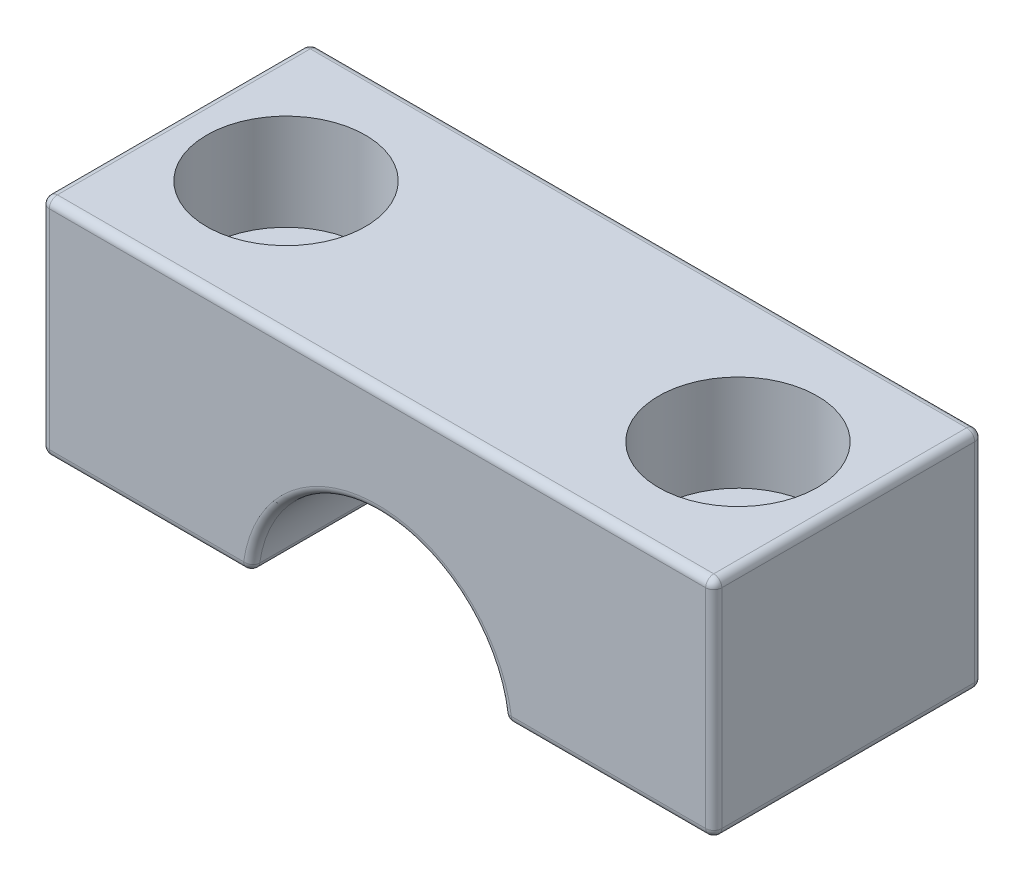
ISO-10303-21;
HEADER;
FILE_DESCRIPTION(('STEP AP214'),'2;1');
FILE_NAME('part.step','',(''),(''),'','','');
FILE_SCHEMA(('AUTOMOTIVE_DESIGN { 1 0 10303 214 1 1 1 1 }'));
ENDSEC;
DATA;
#1=APPLICATION_CONTEXT('core data for automotive mechanical design processes');
#2=APPLICATION_PROTOCOL_DEFINITION('international standard','automotive_design',2000,#1);
#3=PRODUCT_CONTEXT('',#1,'mechanical');
#4=PRODUCT('Part','Part','',(#3));
#5=PRODUCT_RELATED_PRODUCT_CATEGORY('part','',(#4));
#6=PRODUCT_DEFINITION_FORMATION('','',#4);
#7=PRODUCT_DEFINITION_CONTEXT('part definition',#1,'design');
#8=PRODUCT_DEFINITION('design','',#6,#7);
#9=PRODUCT_DEFINITION_SHAPE('','',#8);
#10=(LENGTH_UNIT() NAMED_UNIT(*) SI_UNIT(.MILLI.,.METRE.));
#11=(NAMED_UNIT(*) PLANE_ANGLE_UNIT() SI_UNIT($,.RADIAN.));
#12=(NAMED_UNIT(*) SI_UNIT($,.STERADIAN.) SOLID_ANGLE_UNIT());
#13=UNCERTAINTY_MEASURE_WITH_UNIT(LENGTH_MEASURE(1.E-05),#10,'distance_accuracy_value','');
#14=(GEOMETRIC_REPRESENTATION_CONTEXT(3) GLOBAL_UNCERTAINTY_ASSIGNED_CONTEXT((#13)) GLOBAL_UNIT_ASSIGNED_CONTEXT((#10,
#11,#12)) REPRESENTATION_CONTEXT('',''));
#15=CARTESIAN_POINT('',(0.,0.,0.));
#16=DIRECTION('',(0.,0.,1.));
#17=DIRECTION('',(1.,0.,0.));
#18=AXIS2_PLACEMENT_3D('',#15,#16,#17);
#19=CARTESIAN_POINT('',(-10.668,0.,-6.35));
#20=DIRECTION('',(0.,1.,0.));
#21=DIRECTION('',(-1.,0.,0.));
#22=AXIS2_PLACEMENT_3D('',#19,#20,#21);
#23=CYLINDRICAL_SURFACE('',#22,2.3368);
#24=CARTESIAN_POINT('',(-10.668,19.558,-6.35));
#25=DIRECTION('',(0.,-1.,0.));
#26=DIRECTION('',(1.,0.,0.));
#27=AXIS2_PLACEMENT_3D('',#24,#25,#26);
#28=CIRCLE('',#27,2.3368);
#29=CARTESIAN_POINT('',(-8.3312,19.558,-6.35));
#30=VERTEX_POINT('',#29);
#31=EDGE_CURVE('E382',#30,#30,#28,.T.);
#32=ORIENTED_EDGE('',*,*,#31,.T.);
#33=EDGE_LOOP('',(#32));
#34=FACE_BOUND('',#33,.T.);
#35=CARTESIAN_POINT('',(-10.668,25.6159,-6.35));
#36=DIRECTION('',(0.,1.,0.));
#37=DIRECTION('',(-1.,0.,0.));
#38=AXIS2_PLACEMENT_3D('',#35,#36,#37);
#39=CIRCLE('',#38,2.3368);
#40=CARTESIAN_POINT('',(-13.0048,25.6159,-6.35));
#41=VERTEX_POINT('',#40);
#42=EDGE_CURVE('E372',#41,#41,#39,.F.);
#43=ORIENTED_EDGE('',*,*,#42,.F.);
#44=EDGE_LOOP('',(#43));
#45=FACE_BOUND('',#44,.T.);
#46=ADVANCED_FACE('F41',(#34,#45),#23,.F.);
#47=CARTESIAN_POINT('',(-15.875,19.558,-12.7));
#48=DIRECTION('',(-1.,0.,0.));
#49=DIRECTION('',(0.,0.,1.));
#50=AXIS2_PLACEMENT_3D('',#47,#48,#49);
#51=PLANE('',#50);
#52=DIRECTION('',(0.,0.,1.));
#53=VECTOR('',#52,1.);
#54=CARTESIAN_POINT('',(-15.875,29.7815,-12.7));
#55=LINE('',#54,#53);
#56=CARTESIAN_POINT('',(-15.875,29.7815,-0.381));
#57=VERTEX_POINT('',#56);
#58=CARTESIAN_POINT('',(-15.875,29.7815,-12.319));
#59=VERTEX_POINT('',#58);
#60=EDGE_CURVE('E61',#57,#59,#55,.F.);
#61=ORIENTED_EDGE('',*,*,#60,.T.);
#62=DIRECTION('',(0.,-1.,0.));
#63=VECTOR('',#62,1.);
#64=CARTESIAN_POINT('',(-15.875,19.558,-12.319));
#65=LINE('',#64,#63);
#66=CARTESIAN_POINT('',(-15.875,19.939,-12.319));
#67=VERTEX_POINT('',#66);
#68=EDGE_CURVE('E11',#59,#67,#65,.T.);
#69=ORIENTED_EDGE('',*,*,#68,.T.);
#70=DIRECTION('',(0.,0.,1.));
#71=VECTOR('',#70,1.);
#72=CARTESIAN_POINT('',(-15.875,19.939,-12.7));
#73=LINE('',#72,#71);
#74=CARTESIAN_POINT('',(-15.875,19.939,-0.381));
#75=VERTEX_POINT('',#74);
#76=EDGE_CURVE('E50',#67,#75,#73,.T.);
#77=ORIENTED_EDGE('',*,*,#76,.T.);
#78=DIRECTION('',(0.,-1.,0.));
#79=VECTOR('',#78,1.);
#80=CARTESIAN_POINT('',(-15.875,19.558,-0.380999999999999));
#81=LINE('',#80,#79);
#82=EDGE_CURVE('E265',#75,#57,#81,.F.);
#83=ORIENTED_EDGE('',*,*,#82,.T.);
#84=EDGE_LOOP('',(#61,#69,#77,#83));
#85=FACE_BOUND('',#84,.T.);
#86=ADVANCED_FACE('F446',(#85),#51,.T.);
#87=CARTESIAN_POINT('',(-15.875,30.1625,-12.7));
#88=DIRECTION('',(0.,1.,0.));
#89=DIRECTION('',(-1.,0.,0.));
#90=AXIS2_PLACEMENT_3D('',#87,#88,#89);
#91=PLANE('',#90);
#92=DIRECTION('',(-1.,0.,0.));
#93=VECTOR('',#92,1.);
#94=CARTESIAN_POINT('',(-15.875,30.1625,-0.380999999999999));
#95=LINE('',#94,#93);
#96=CARTESIAN_POINT('',(-15.494,30.1625,-0.381));
#97=VERTEX_POINT('',#96);
#98=CARTESIAN_POINT('',(15.494,30.1625,-0.381));
#99=VERTEX_POINT('',#98);
#100=EDGE_CURVE('E201',#97,#99,#95,.F.);
#101=ORIENTED_EDGE('',*,*,#100,.T.);
#102=DIRECTION('',(0.,0.,1.));
#103=VECTOR('',#102,1.);
#104=CARTESIAN_POINT('',(15.494,30.1625,-12.7));
#105=LINE('',#104,#103);
#106=CARTESIAN_POINT('',(15.494,30.1625,-12.319));
#107=VERTEX_POINT('',#106);
#108=EDGE_CURVE('E172',#99,#107,#105,.F.);
#109=ORIENTED_EDGE('',*,*,#108,.T.);
#110=DIRECTION('',(-1.,0.,0.));
#111=VECTOR('',#110,1.);
#112=CARTESIAN_POINT('',(-15.875,30.1625,-12.319));
#113=LINE('',#112,#111);
#114=CARTESIAN_POINT('',(-15.494,30.1625,-12.319));
#115=VERTEX_POINT('',#114);
#116=EDGE_CURVE('E209',#107,#115,#113,.T.);
#117=ORIENTED_EDGE('',*,*,#116,.T.);
#118=DIRECTION('',(0.,0.,1.));
#119=VECTOR('',#118,1.);
#120=CARTESIAN_POINT('',(-15.494,30.1625,-12.7));
#121=LINE('',#120,#119);
#122=EDGE_CURVE('E203',#115,#97,#121,.T.);
#123=ORIENTED_EDGE('',*,*,#122,.T.);
#124=EDGE_LOOP('',(#101,#109,#117,#123));
#125=FACE_BOUND('',#124,.T.);
#126=CARTESIAN_POINT('',(-10.668,30.1625,-6.35));
#127=DIRECTION('',(0.,1.,0.));
#128=DIRECTION('',(-1.,0.,0.));
#129=AXIS2_PLACEMENT_3D('',#126,#127,#128);
#130=CIRCLE('',#129,3.7465);
#131=CARTESIAN_POINT('',(-14.4145,30.1625,-6.35));
#132=VERTEX_POINT('',#131);
#133=EDGE_CURVE('E361',#132,#132,#130,.T.);
#134=ORIENTED_EDGE('',*,*,#133,.F.);
#135=EDGE_LOOP('',(#134));
#136=FACE_BOUND('',#135,.T.);
#137=CARTESIAN_POINT('',(10.668,30.1625,-6.35));
#138=DIRECTION('',(0.,1.,0.));
#139=DIRECTION('',(1.,0.,0.));
#140=AXIS2_PLACEMENT_3D('',#137,#138,#139);
#141=CIRCLE('',#140,3.7465);
#142=CARTESIAN_POINT('',(14.4145,30.1625,-6.35));
#143=VERTEX_POINT('',#142);
#144=EDGE_CURVE('E379',#143,#143,#141,.T.);
#145=ORIENTED_EDGE('',*,*,#144,.F.);
#146=EDGE_LOOP('',(#145));
#147=FACE_BOUND('',#146,.T.);
#148=ADVANCED_FACE('F414',(#125,#136,#147),#91,.T.);
#149=CARTESIAN_POINT('',(15.875,19.558,-12.7));
#150=DIRECTION('',(1.,0.,0.));
#151=DIRECTION('',(0.,0.,-1.));
#152=AXIS2_PLACEMENT_3D('',#149,#150,#151);
#153=PLANE('',#152);
#154=DIRECTION('',(0.,1.,0.));
#155=VECTOR('',#154,1.);
#156=CARTESIAN_POINT('',(15.875,30.1625,-12.319));
#157=LINE('',#156,#155);
#158=CARTESIAN_POINT('',(15.875,19.939,-12.319));
#159=VERTEX_POINT('',#158);
#160=CARTESIAN_POINT('',(15.875,29.7815,-12.319));
#161=VERTEX_POINT('',#160);
#162=EDGE_CURVE('E199',#159,#161,#157,.T.);
#163=ORIENTED_EDGE('',*,*,#162,.T.);
#164=DIRECTION('',(0.,0.,1.));
#165=VECTOR('',#164,1.);
#166=CARTESIAN_POINT('',(15.875,29.7815,-12.7));
#167=LINE('',#166,#165);
#168=CARTESIAN_POINT('',(15.875,29.7815,-0.381));
#169=VERTEX_POINT('',#168);
#170=EDGE_CURVE('E170',#161,#169,#167,.T.);
#171=ORIENTED_EDGE('',*,*,#170,.T.);
#172=DIRECTION('',(0.,1.,0.));
#173=VECTOR('',#172,1.);
#174=CARTESIAN_POINT('',(15.875,19.558,-0.380999999999999));
#175=LINE('',#174,#173);
#176=CARTESIAN_POINT('',(15.875,19.939,-0.381));
#177=VERTEX_POINT('',#176);
#178=EDGE_CURVE('E188',#169,#177,#175,.F.);
#179=ORIENTED_EDGE('',*,*,#178,.T.);
#180=DIRECTION('',(0.,0.,1.));
#181=VECTOR('',#180,1.);
#182=CARTESIAN_POINT('',(15.875,19.939,-12.7));
#183=LINE('',#182,#181);
#184=EDGE_CURVE('E194',#177,#159,#183,.F.);
#185=ORIENTED_EDGE('',*,*,#184,.T.);
#186=EDGE_LOOP('',(#163,#171,#179,#185));
#187=FACE_BOUND('',#186,.T.);
#188=ADVANCED_FACE('F197',(#187),#153,.T.);
#189=CARTESIAN_POINT('',(5.97845598796211,19.558,-12.7));
#190=DIRECTION('',(0.,-1.,0.));
#191=DIRECTION('',(1.,0.,0.));
#192=AXIS2_PLACEMENT_3D('',#189,#190,#191);
#193=PLANE('',#192);
#194=DIRECTION('',(0.,0.,1.));
#195=VECTOR('',#194,1.);
#196=CARTESIAN_POINT('',(6.31876886742979,19.558,-12.7));
#197=LINE('',#196,#195);
#198=CARTESIAN_POINT('',(6.31876886742979,19.558,-0.381));
#199=VERTEX_POINT('',#198);
#200=CARTESIAN_POINT('',(6.31876886742979,19.558,-12.319));
#201=VERTEX_POINT('',#200);
#202=EDGE_CURVE('E227',#199,#201,#197,.F.);
#203=ORIENTED_EDGE('',*,*,#202,.T.);
#204=DIRECTION('',(1.,0.,0.));
#205=VECTOR('',#204,1.);
#206=CARTESIAN_POINT('',(15.875,19.558,-12.319));
#207=LINE('',#206,#205);
#208=CARTESIAN_POINT('',(15.494,19.558,-12.319));
#209=VERTEX_POINT('',#208);
#210=EDGE_CURVE('E232',#201,#209,#207,.T.);
#211=ORIENTED_EDGE('',*,*,#210,.T.);
#212=DIRECTION('',(0.,0.,1.));
#213=VECTOR('',#212,1.);
#214=CARTESIAN_POINT('',(15.494,19.558,-12.7));
#215=LINE('',#214,#213);
#216=CARTESIAN_POINT('',(15.494,19.558,-0.381));
#217=VERTEX_POINT('',#216);
#218=EDGE_CURVE('E229',#209,#217,#215,.T.);
#219=ORIENTED_EDGE('',*,*,#218,.T.);
#220=DIRECTION('',(1.,0.,0.));
#221=VECTOR('',#220,1.);
#222=CARTESIAN_POINT('',(5.97845598796211,19.558,-0.380999999999999));
#223=LINE('',#222,#221);
#224=EDGE_CURVE('E225',#217,#199,#223,.F.);
#225=ORIENTED_EDGE('',*,*,#224,.T.);
#226=EDGE_LOOP('',(#203,#211,#219,#225));
#227=FACE_BOUND('',#226,.T.);
#228=CARTESIAN_POINT('',(10.668,19.558,-6.35));
#229=DIRECTION('',(0.,-1.,0.));
#230=DIRECTION('',(1.,0.,0.));
#231=AXIS2_PLACEMENT_3D('',#228,#229,#230);
#232=CIRCLE('',#231,2.3368);
#233=CARTESIAN_POINT('',(13.0048,19.558,-6.35));
#234=VERTEX_POINT('',#233);
#235=EDGE_CURVE('E195',#234,#234,#232,.T.);
#236=ORIENTED_EDGE('',*,*,#235,.F.);
#237=EDGE_LOOP('',(#236));
#238=FACE_BOUND('',#237,.T.);
#239=ADVANCED_FACE('F470',(#227,#238),#193,.T.);
#240=CARTESIAN_POINT('',(0.,19.05,-12.7));
#241=DIRECTION('',(0.,0.,1.));
#242=DIRECTION('',(1.,0.,0.));
#243=AXIS2_PLACEMENT_3D('',#240,#241,#242);
#244=CYLINDRICAL_SURFACE('',#243,6.);
#245=DIRECTION('',(0.,0.,1.));
#246=VECTOR('',#245,1.);
#247=CARTESIAN_POINT('',(5.94148459560864,19.8859191349318,-12.7));
#248=LINE('',#247,#246);
#249=CARTESIAN_POINT('',(5.94148459560864,19.8859191349318,-12.319));
#250=VERTEX_POINT('',#249);
#251=CARTESIAN_POINT('',(5.94148459560864,19.8859191349318,-0.380999999999999));
#252=VERTEX_POINT('',#251);
#253=EDGE_CURVE('E251',#250,#252,#248,.T.);
#254=ORIENTED_EDGE('',*,*,#253,.T.);
#255=CARTESIAN_POINT('',(0.,19.05,-0.380999999999999));
#256=DIRECTION('',(0.,0.,1.));
#257=DIRECTION('',(1.,0.,0.));
#258=AXIS2_PLACEMENT_3D('',#255,#256,#257);
#259=CIRCLE('',#258,6.);
#260=CARTESIAN_POINT('',(-5.94148459560864,19.8859191349318,-0.380999999999999));
#261=VERTEX_POINT('',#260);
#262=EDGE_CURVE('E254',#252,#261,#259,.T.);
#263=ORIENTED_EDGE('',*,*,#262,.T.);
#264=DIRECTION('',(0.,0.,1.));
#265=VECTOR('',#264,1.);
#266=CARTESIAN_POINT('',(-5.94148459560864,19.8859191349318,-12.7));
#267=LINE('',#266,#265);
#268=CARTESIAN_POINT('',(-5.94148459560864,19.8859191349318,-12.319));
#269=VERTEX_POINT('',#268);
#270=EDGE_CURVE('E249',#261,#269,#267,.F.);
#271=ORIENTED_EDGE('',*,*,#270,.T.);
#272=CARTESIAN_POINT('',(0.,19.05,-12.319));
#273=DIRECTION('',(0.,0.,1.));
#274=DIRECTION('',(1.,0.,0.));
#275=AXIS2_PLACEMENT_3D('',#272,#273,#274);
#276=CIRCLE('',#275,6.);
#277=EDGE_CURVE('E247',#269,#250,#276,.F.);
#278=ORIENTED_EDGE('',*,*,#277,.T.);
#279=EDGE_LOOP('',(#254,#263,#271,#278));
#280=FACE_BOUND('',#279,.T.);
#281=ADVANCED_FACE('F473',(#280),#244,.F.);
#282=CARTESIAN_POINT('',(-15.875,19.558,-12.7));
#283=DIRECTION('',(0.,-1.,0.));
#284=DIRECTION('',(1.,0.,0.));
#285=AXIS2_PLACEMENT_3D('',#282,#283,#284);
#286=PLANE('',#285);
#287=DIRECTION('',(1.,0.,0.));
#288=VECTOR('',#287,1.);
#289=CARTESIAN_POINT('',(-5.97845598796211,19.558,-12.319));
#290=LINE('',#289,#288);
#291=CARTESIAN_POINT('',(-15.494,19.558,-12.319));
#292=VERTEX_POINT('',#291);
#293=CARTESIAN_POINT('',(-6.31876886742979,19.558,-12.319));
#294=VERTEX_POINT('',#293);
#295=EDGE_CURVE('E260',#292,#294,#290,.T.);
#296=ORIENTED_EDGE('',*,*,#295,.T.);
#297=DIRECTION('',(0.,0.,1.));
#298=VECTOR('',#297,1.);
#299=CARTESIAN_POINT('',(-6.31876886742979,19.558,-12.7));
#300=LINE('',#299,#298);
#301=CARTESIAN_POINT('',(-6.31876886742979,19.558,-0.381));
#302=VERTEX_POINT('',#301);
#303=EDGE_CURVE('E262',#294,#302,#300,.T.);
#304=ORIENTED_EDGE('',*,*,#303,.T.);
#305=DIRECTION('',(1.,0.,0.));
#306=VECTOR('',#305,1.);
#307=CARTESIAN_POINT('',(-15.875,19.558,-0.380999999999999));
#308=LINE('',#307,#306);
#309=CARTESIAN_POINT('',(-15.494,19.558,-0.381));
#310=VERTEX_POINT('',#309);
#311=EDGE_CURVE('E256',#302,#310,#308,.F.);
#312=ORIENTED_EDGE('',*,*,#311,.T.);
#313=DIRECTION('',(0.,0.,1.));
#314=VECTOR('',#313,1.);
#315=CARTESIAN_POINT('',(-15.494,19.558,-12.7));
#316=LINE('',#315,#314);
#317=EDGE_CURVE('E258',#310,#292,#316,.F.);
#318=ORIENTED_EDGE('',*,*,#317,.T.);
#319=EDGE_LOOP('',(#296,#304,#312,#318));
#320=FACE_BOUND('',#319,.T.);
#321=ORIENTED_EDGE('',*,*,#31,.F.);
#322=EDGE_LOOP('',(#321));
#323=FACE_BOUND('',#322,.T.);
#324=ADVANCED_FACE('F462',(#320,#323),#286,.T.);
#325=CARTESIAN_POINT('',(0.,19.05,-12.7));
#326=DIRECTION('',(0.,0.,1.));
#327=DIRECTION('',(1.,0.,0.));
#328=AXIS2_PLACEMENT_3D('',#325,#326,#327);
#329=PLANE('',#328);
#330=DIRECTION('',(0.,1.,0.));
#331=VECTOR('',#330,1.);
#332=CARTESIAN_POINT('',(15.494,19.558,-12.7));
#333=LINE('',#332,#331);
#334=CARTESIAN_POINT('',(15.494,29.7815,-12.7));
#335=VERTEX_POINT('',#334);
#336=CARTESIAN_POINT('',(15.494,19.939,-12.7));
#337=VERTEX_POINT('',#336);
#338=EDGE_CURVE('E220',#335,#337,#333,.F.);
#339=ORIENTED_EDGE('',*,*,#338,.T.);
#340=DIRECTION('',(1.,0.,0.));
#341=VECTOR('',#340,1.);
#342=CARTESIAN_POINT('',(5.97845598796211,19.939,-12.7));
#343=LINE('',#342,#341);
#344=CARTESIAN_POINT('',(6.31876886742979,19.939,-12.7));
#345=VERTEX_POINT('',#344);
#346=EDGE_CURVE('E223',#337,#345,#343,.F.);
#347=ORIENTED_EDGE('',*,*,#346,.T.);
#348=CARTESIAN_POINT('',(0.,19.05,-12.7));
#349=DIRECTION('',(0.,0.,1.));
#350=DIRECTION('',(1.,0.,0.));
#351=AXIS2_PLACEMENT_3D('',#348,#349,#350);
#352=CIRCLE('',#351,6.381);
#353=CARTESIAN_POINT('',(-6.31876886742979,19.939,-12.7));
#354=VERTEX_POINT('',#353);
#355=EDGE_CURVE('E218',#345,#354,#352,.T.);
#356=ORIENTED_EDGE('',*,*,#355,.T.);
#357=DIRECTION('',(1.,0.,0.));
#358=VECTOR('',#357,1.);
#359=CARTESIAN_POINT('',(-15.875,19.939,-12.7));
#360=LINE('',#359,#358);
#361=CARTESIAN_POINT('',(-15.494,19.939,-12.7));
#362=VERTEX_POINT('',#361);
#363=EDGE_CURVE('E216',#354,#362,#360,.F.);
#364=ORIENTED_EDGE('',*,*,#363,.T.);
#365=DIRECTION('',(0.,-1.,0.));
#366=VECTOR('',#365,1.);
#367=CARTESIAN_POINT('',(-15.494,30.1625,-12.7));
#368=LINE('',#367,#366);
#369=CARTESIAN_POINT('',(-15.494,29.7815,-12.7));
#370=VERTEX_POINT('',#369);
#371=EDGE_CURVE('E212',#362,#370,#368,.F.);
#372=ORIENTED_EDGE('',*,*,#371,.T.);
#373=DIRECTION('',(-1.,0.,0.));
#374=VECTOR('',#373,1.);
#375=CARTESIAN_POINT('',(15.875,29.7815,-12.7));
#376=LINE('',#375,#374);
#377=EDGE_CURVE('E214',#370,#335,#376,.F.);
#378=ORIENTED_EDGE('',*,*,#377,.T.);
#379=EDGE_LOOP('',(#339,#347,#356,#364,#372,#378));
#380=FACE_BOUND('',#379,.T.);
#381=ADVANCED_FACE('F459',(#380),#329,.F.);
#382=CARTESIAN_POINT('',(0.,19.05,0.));
#383=DIRECTION('',(0.,0.,1.));
#384=DIRECTION('',(1.,0.,0.));
#385=AXIS2_PLACEMENT_3D('',#382,#383,#384);
#386=PLANE('',#385);
#387=CARTESIAN_POINT('',(0.,19.05,0.));
#388=DIRECTION('',(0.,0.,1.));
#389=DIRECTION('',(1.,0.,0.));
#390=AXIS2_PLACEMENT_3D('',#387,#388,#389);
#391=CIRCLE('',#390,6.381);
#392=CARTESIAN_POINT('',(-6.31876886742979,19.939,0.));
#393=VERTEX_POINT('',#392);
#394=CARTESIAN_POINT('',(6.31876886742979,19.939,0.));
#395=VERTEX_POINT('',#394);
#396=EDGE_CURVE('E240',#393,#395,#391,.F.);
#397=ORIENTED_EDGE('',*,*,#396,.T.);
#398=DIRECTION('',(1.,0.,0.));
#399=VECTOR('',#398,1.);
#400=CARTESIAN_POINT('',(0.,19.939,0.));
#401=LINE('',#400,#399);
#402=CARTESIAN_POINT('',(15.494,19.939,0.));
#403=VERTEX_POINT('',#402);
#404=EDGE_CURVE('E245',#395,#403,#401,.T.);
#405=ORIENTED_EDGE('',*,*,#404,.T.);
#406=DIRECTION('',(0.,1.,0.));
#407=VECTOR('',#406,1.);
#408=CARTESIAN_POINT('',(15.494,19.05,0.));
#409=LINE('',#408,#407);
#410=CARTESIAN_POINT('',(15.494,29.7815,0.));
#411=VERTEX_POINT('',#410);
#412=EDGE_CURVE('E242',#403,#411,#409,.T.);
#413=ORIENTED_EDGE('',*,*,#412,.T.);
#414=DIRECTION('',(-1.,0.,0.));
#415=VECTOR('',#414,1.);
#416=CARTESIAN_POINT('',(0.,29.7815,0.));
#417=LINE('',#416,#415);
#418=CARTESIAN_POINT('',(-15.494,29.7815,0.));
#419=VERTEX_POINT('',#418);
#420=EDGE_CURVE('E234',#411,#419,#417,.T.);
#421=ORIENTED_EDGE('',*,*,#420,.T.);
#422=DIRECTION('',(0.,-1.,0.));
#423=VECTOR('',#422,1.);
#424=CARTESIAN_POINT('',(-15.494,19.05,0.));
#425=LINE('',#424,#423);
#426=CARTESIAN_POINT('',(-15.494,19.939,0.));
#427=VERTEX_POINT('',#426);
#428=EDGE_CURVE('E236',#419,#427,#425,.T.);
#429=ORIENTED_EDGE('',*,*,#428,.T.);
#430=DIRECTION('',(1.,0.,0.));
#431=VECTOR('',#430,1.);
#432=CARTESIAN_POINT('',(0.,19.939,0.));
#433=LINE('',#432,#431);
#434=EDGE_CURVE('E238',#427,#393,#433,.T.);
#435=ORIENTED_EDGE('',*,*,#434,.T.);
#436=EDGE_LOOP('',(#397,#405,#413,#421,#429,#435));
#437=FACE_BOUND('',#436,.T.);
#438=ADVANCED_FACE('F423',(#437),#386,.T.);
#439=CARTESIAN_POINT('',(10.668,0.,-6.35));
#440=DIRECTION('',(0.,1.,0.));
#441=DIRECTION('',(-1.,0.,0.));
#442=AXIS2_PLACEMENT_3D('',#439,#440,#441);
#443=CYLINDRICAL_SURFACE('',#442,2.3368);
#444=CARTESIAN_POINT('',(10.668,25.6159,-6.35));
#445=DIRECTION('',(0.,-1.,0.));
#446=DIRECTION('',(1.,0.,0.));
#447=AXIS2_PLACEMENT_3D('',#444,#445,#446);
#448=CIRCLE('',#447,2.3368);
#449=CARTESIAN_POINT('',(13.0048,25.6159,-6.35));
#450=VERTEX_POINT('',#449);
#451=EDGE_CURVE('E378',#450,#450,#448,.F.);
#452=ORIENTED_EDGE('',*,*,#451,.T.);
#453=EDGE_LOOP('',(#452));
#454=FACE_BOUND('',#453,.T.);
#455=ORIENTED_EDGE('',*,*,#235,.T.);
#456=EDGE_LOOP('',(#455));
#457=FACE_BOUND('',#456,.T.);
#458=ADVANCED_FACE('F457',(#454,#457),#443,.F.);
#459=CARTESIAN_POINT('',(10.668,25.6159,-6.35));
#460=DIRECTION('',(0.,-1.,0.));
#461=DIRECTION('',(1.,0.,0.));
#462=AXIS2_PLACEMENT_3D('',#459,#460,#461);
#463=PLANE('',#462);
#464=CARTESIAN_POINT('',(10.668,25.6159,-6.35));
#465=DIRECTION('',(0.,1.,0.));
#466=DIRECTION('',(1.,0.,0.));
#467=AXIS2_PLACEMENT_3D('',#464,#465,#466);
#468=CIRCLE('',#467,3.7465);
#469=CARTESIAN_POINT('',(14.4145,25.6159,-6.35));
#470=VERTEX_POINT('',#469);
#471=EDGE_CURVE('E375',#470,#470,#468,.T.);
#472=ORIENTED_EDGE('',*,*,#471,.T.);
#473=EDGE_LOOP('',(#472));
#474=FACE_BOUND('',#473,.T.);
#475=ORIENTED_EDGE('',*,*,#451,.F.);
#476=EDGE_LOOP('',(#475));
#477=FACE_BOUND('',#476,.T.);
#478=ADVANCED_FACE('F797',(#474,#477),#463,.F.);
#479=CARTESIAN_POINT('',(10.668,25.6159,-6.35));
#480=DIRECTION('',(0.,1.,0.));
#481=DIRECTION('',(-1.,0.,0.));
#482=AXIS2_PLACEMENT_3D('',#479,#480,#481);
#483=CYLINDRICAL_SURFACE('',#482,3.7465);
#484=ORIENTED_EDGE('',*,*,#471,.F.);
#485=EDGE_LOOP('',(#484));
#486=FACE_BOUND('',#485,.T.);
#487=ORIENTED_EDGE('',*,*,#144,.T.);
#488=EDGE_LOOP('',(#487));
#489=FACE_BOUND('',#488,.T.);
#490=ADVANCED_FACE('F788',(#486,#489),#483,.F.);
#491=CARTESIAN_POINT('',(-10.668,25.6159,-6.35));
#492=DIRECTION('',(0.,1.,0.));
#493=DIRECTION('',(-1.,0.,0.));
#494=AXIS2_PLACEMENT_3D('',#491,#492,#493);
#495=PLANE('',#494);
#496=CARTESIAN_POINT('',(-10.668,25.6159,-6.35));
#497=DIRECTION('',(0.,1.,0.));
#498=DIRECTION('',(-1.,0.,0.));
#499=AXIS2_PLACEMENT_3D('',#496,#497,#498);
#500=CIRCLE('',#499,3.7465);
#501=CARTESIAN_POINT('',(-14.4145,25.6159,-6.35));
#502=VERTEX_POINT('',#501);
#503=EDGE_CURVE('E367',#502,#502,#500,.T.);
#504=ORIENTED_EDGE('',*,*,#503,.T.);
#505=EDGE_LOOP('',(#504));
#506=FACE_BOUND('',#505,.T.);
#507=ORIENTED_EDGE('',*,*,#42,.T.);
#508=EDGE_LOOP('',(#507));
#509=FACE_BOUND('',#508,.T.);
#510=ADVANCED_FACE('F779',(#506,#509),#495,.T.);
#511=CARTESIAN_POINT('',(-10.668,25.6159,-6.35));
#512=DIRECTION('',(0.,1.,0.));
#513=DIRECTION('',(-1.,0.,0.));
#514=AXIS2_PLACEMENT_3D('',#511,#512,#513);
#515=CYLINDRICAL_SURFACE('',#514,3.7465);
#516=ORIENTED_EDGE('',*,*,#503,.F.);
#517=EDGE_LOOP('',(#516));
#518=FACE_BOUND('',#517,.T.);
#519=ORIENTED_EDGE('',*,*,#133,.T.);
#520=EDGE_LOOP('',(#519));
#521=FACE_BOUND('',#520,.T.);
#522=ADVANCED_FACE('F771',(#518,#521),#515,.F.);
#523=CARTESIAN_POINT('',(-6.31876886742979,19.939,-12.7));
#524=DIRECTION('',(0.,0.,1.));
#525=DIRECTION('',(1.,0.,0.));
#526=AXIS2_PLACEMENT_3D('',#523,#524,#525);
#527=CYLINDRICAL_SURFACE('',#526,0.381);
#528=CARTESIAN_POINT('',(-6.31876886742979,19.939,-12.319));
#529=DIRECTION('',(0.,0.,-1.));
#530=DIRECTION('',(-1.,0.,0.));
#531=AXIS2_PLACEMENT_3D('',#528,#529,#530);
#532=CIRCLE('',#531,0.381);
#533=EDGE_CURVE('E45',#269,#294,#532,.T.);
#534=ORIENTED_EDGE('',*,*,#533,.F.);
#535=ORIENTED_EDGE('',*,*,#270,.F.);
#536=CARTESIAN_POINT('',(-6.31876886742979,19.939,-0.381));
#537=DIRECTION('',(0.,0.,1.));
#538=DIRECTION('',(1.,0.,0.));
#539=AXIS2_PLACEMENT_3D('',#536,#537,#538);
#540=CIRCLE('',#539,0.381);
#541=EDGE_CURVE('E354',#302,#261,#540,.T.);
#542=ORIENTED_EDGE('',*,*,#541,.F.);
#543=ORIENTED_EDGE('',*,*,#303,.F.);
#544=EDGE_LOOP('',(#534,#535,#542,#543));
#545=FACE_BOUND('',#544,.T.);
#546=ADVANCED_FACE('F43',(#545),#527,.T.);
#547=CARTESIAN_POINT('',(-6.31876886742979,19.939,-12.319));
#548=DIRECTION('',(0.,0.,1.));
#549=DIRECTION('',(1.,0.,0.));
#550=AXIS2_PLACEMENT_3D('',#547,#548,#549);
#551=SPHERICAL_SURFACE('',#550,0.381);
#552=CARTESIAN_POINT('',(-6.31876886742979,19.939,-12.319));
#553=DIRECTION('',(-0.139319855821969,-0.990247432601441,0.));
#554=DIRECTION('',(0.990247432601441,-0.139319855821969,0.));
#555=AXIS2_PLACEMENT_3D('',#552,#553,#554);
#556=CIRCLE('',#555,0.381);
#557=EDGE_CURVE('E349',#269,#354,#556,.F.);
#558=ORIENTED_EDGE('',*,*,#557,.F.);
#559=ORIENTED_EDGE('',*,*,#533,.T.);
#560=CARTESIAN_POINT('',(-6.31876886742979,19.939,-12.319));
#561=DIRECTION('',(1.,0.,0.));
#562=DIRECTION('',(0.,0.,-1.));
#563=AXIS2_PLACEMENT_3D('',#560,#561,#562);
#564=CIRCLE('',#563,0.381);
#565=EDGE_CURVE('E352',#354,#294,#564,.F.);
#566=ORIENTED_EDGE('',*,*,#565,.F.);
#567=EDGE_LOOP('',(#558,#559,#566));
#568=FACE_BOUND('',#567,.T.);
#569=ADVANCED_FACE('F757',(#568),#551,.T.);
#570=CARTESIAN_POINT('',(-6.31876886742979,19.939,-0.381));
#571=DIRECTION('',(0.,0.,1.));
#572=DIRECTION('',(1.,0.,0.));
#573=AXIS2_PLACEMENT_3D('',#570,#571,#572);
#574=SPHERICAL_SURFACE('',#573,0.381);
#575=CARTESIAN_POINT('',(-6.31876886742979,19.939,-0.381));
#576=DIRECTION('',(1.,0.,0.));
#577=DIRECTION('',(0.,0.,-1.));
#578=AXIS2_PLACEMENT_3D('',#575,#576,#577);
#579=CIRCLE('',#578,0.381);
#580=EDGE_CURVE('E343',#302,#393,#579,.F.);
#581=ORIENTED_EDGE('',*,*,#580,.F.);
#582=ORIENTED_EDGE('',*,*,#541,.T.);
#583=CARTESIAN_POINT('',(-6.31876886742979,19.939,-0.380999999999999));
#584=DIRECTION('',(-0.139319855821969,-0.990247432601441,0.));
#585=DIRECTION('',(0.990247432601441,-0.139319855821969,0.));
#586=AXIS2_PLACEMENT_3D('',#583,#584,#585);
#587=CIRCLE('',#586,0.381);
#588=EDGE_CURVE('E346',#393,#261,#587,.F.);
#589=ORIENTED_EDGE('',*,*,#588,.F.);
#590=EDGE_LOOP('',(#581,#582,#589));
#591=FACE_BOUND('',#590,.T.);
#592=ADVANCED_FACE('F748',(#591),#574,.T.);
#593=CARTESIAN_POINT('',(-15.875,19.939,-12.319));
#594=DIRECTION('',(-1.,0.,0.));
#595=DIRECTION('',(0.,-1.,0.));
#596=AXIS2_PLACEMENT_3D('',#593,#594,#595);
#597=CYLINDRICAL_SURFACE('',#596,0.381);
#598=ORIENTED_EDGE('',*,*,#565,.T.);
#599=ORIENTED_EDGE('',*,*,#295,.F.);
#600=CARTESIAN_POINT('',(-15.494,19.939,-12.319));
#601=DIRECTION('',(-1.,0.,0.));
#602=DIRECTION('',(0.,0.,1.));
#603=AXIS2_PLACEMENT_3D('',#600,#601,#602);
#604=CIRCLE('',#603,0.381);
#605=EDGE_CURVE('E337',#362,#292,#604,.T.);
#606=ORIENTED_EDGE('',*,*,#605,.F.);
#607=ORIENTED_EDGE('',*,*,#363,.F.);
#608=EDGE_LOOP('',(#598,#599,#606,#607));
#609=FACE_BOUND('',#608,.T.);
#610=ADVANCED_FACE('F739',(#609),#597,.T.);
#611=CARTESIAN_POINT('',(0.,19.05,-12.319));
#612=DIRECTION('',(0.,0.,1.));
#613=DIRECTION('',(1.,0.,0.));
#614=AXIS2_PLACEMENT_3D('',#611,#612,#613);
#615=TOROIDAL_SURFACE('',#614,6.381,0.381);
#616=ORIENTED_EDGE('',*,*,#557,.T.);
#617=ORIENTED_EDGE('',*,*,#355,.F.);
#618=CARTESIAN_POINT('',(6.31876886742979,19.939,-12.319));
#619=DIRECTION('',(0.139319855821969,-0.990247432601441,0.));
#620=DIRECTION('',(0.990247432601441,0.139319855821969,0.));
#621=AXIS2_PLACEMENT_3D('',#618,#619,#620);
#622=CIRCLE('',#621,0.381);
#623=EDGE_CURVE('E334',#250,#345,#622,.T.);
#624=ORIENTED_EDGE('',*,*,#623,.F.);
#625=ORIENTED_EDGE('',*,*,#277,.F.);
#626=EDGE_LOOP('',(#616,#617,#624,#625));
#627=FACE_BOUND('',#626,.T.);
#628=ADVANCED_FACE('F730',(#627),#615,.T.);
#629=CARTESIAN_POINT('',(6.31876886742979,19.939,-12.7));
#630=DIRECTION('',(0.,0.,1.));
#631=DIRECTION('',(1.,0.,0.));
#632=AXIS2_PLACEMENT_3D('',#629,#630,#631);
#633=CYLINDRICAL_SURFACE('',#632,0.381);
#634=CARTESIAN_POINT('',(6.31876886742979,19.939,-0.380999999999999));
#635=DIRECTION('',(0.,0.,1.));
#636=DIRECTION('',(0.,-1.,0.));
#637=AXIS2_PLACEMENT_3D('',#634,#635,#636);
#638=CIRCLE('',#637,0.381);
#639=EDGE_CURVE('E328',#252,#199,#638,.T.);
#640=ORIENTED_EDGE('',*,*,#639,.F.);
#641=ORIENTED_EDGE('',*,*,#253,.F.);
#642=CARTESIAN_POINT('',(6.31876886742979,19.939,-12.319));
#643=DIRECTION('',(0.,0.,-1.));
#644=DIRECTION('',(-1.,0.,0.));
#645=AXIS2_PLACEMENT_3D('',#642,#643,#644);
#646=CIRCLE('',#645,0.381);
#647=EDGE_CURVE('E331',#201,#250,#646,.T.);
#648=ORIENTED_EDGE('',*,*,#647,.F.);
#649=ORIENTED_EDGE('',*,*,#202,.F.);
#650=EDGE_LOOP('',(#640,#641,#648,#649));
#651=FACE_BOUND('',#650,.T.);
#652=ADVANCED_FACE('F721',(#651),#633,.T.);
#653=CARTESIAN_POINT('',(0.,19.05,-0.380999999999999));
#654=DIRECTION('',(0.,0.,1.));
#655=DIRECTION('',(1.,0.,0.));
#656=AXIS2_PLACEMENT_3D('',#653,#654,#655);
#657=TOROIDAL_SURFACE('',#656,6.381,0.381);
#658=ORIENTED_EDGE('',*,*,#588,.T.);
#659=ORIENTED_EDGE('',*,*,#262,.F.);
#660=CARTESIAN_POINT('',(6.31876886742979,19.939,-0.381));
#661=DIRECTION('',(0.139319855821969,-0.990247432601441,0.));
#662=DIRECTION('',(0.990247432601441,0.139319855821969,0.));
#663=AXIS2_PLACEMENT_3D('',#660,#661,#662);
#664=CIRCLE('',#663,0.381);
#665=EDGE_CURVE('E326',#395,#252,#664,.T.);
#666=ORIENTED_EDGE('',*,*,#665,.F.);
#667=ORIENTED_EDGE('',*,*,#396,.F.);
#668=EDGE_LOOP('',(#658,#659,#666,#667));
#669=FACE_BOUND('',#668,.T.);
#670=ADVANCED_FACE('F712',(#669),#657,.T.);
#671=CARTESIAN_POINT('',(0.,19.939,-0.381));
#672=DIRECTION('',(1.,0.,0.));
#673=DIRECTION('',(0.,1.,0.));
#674=AXIS2_PLACEMENT_3D('',#671,#672,#673);
#675=CYLINDRICAL_SURFACE('',#674,0.381);
#676=ORIENTED_EDGE('',*,*,#580,.T.);
#677=ORIENTED_EDGE('',*,*,#434,.F.);
#678=CARTESIAN_POINT('',(-15.494,19.939,-0.381));
#679=DIRECTION('',(-1.,0.,0.));
#680=DIRECTION('',(0.,0.,1.));
#681=AXIS2_PLACEMENT_3D('',#678,#679,#680);
#682=CIRCLE('',#681,0.381);
#683=EDGE_CURVE('E323',#310,#427,#682,.T.);
#684=ORIENTED_EDGE('',*,*,#683,.F.);
#685=ORIENTED_EDGE('',*,*,#311,.F.);
#686=EDGE_LOOP('',(#676,#677,#684,#685));
#687=FACE_BOUND('',#686,.T.);
#688=ADVANCED_FACE('F703',(#687),#675,.T.);
#689=CARTESIAN_POINT('',(-15.494,19.939,-12.7));
#690=DIRECTION('',(0.,0.,1.));
#691=DIRECTION('',(1.,0.,0.));
#692=AXIS2_PLACEMENT_3D('',#689,#690,#691);
#693=CYLINDRICAL_SURFACE('',#692,0.381);
#694=CARTESIAN_POINT('',(-15.494,19.939,-12.319));
#695=DIRECTION('',(0.,0.,-1.));
#696=DIRECTION('',(-1.,0.,0.));
#697=AXIS2_PLACEMENT_3D('',#694,#695,#696);
#698=CIRCLE('',#697,0.381);
#699=EDGE_CURVE('E340',#292,#67,#698,.T.);
#700=ORIENTED_EDGE('',*,*,#699,.F.);
#701=ORIENTED_EDGE('',*,*,#317,.F.);
#702=CARTESIAN_POINT('',(-15.494,19.939,-0.381));
#703=DIRECTION('',(0.,0.,1.));
#704=DIRECTION('',(1.,0.,0.));
#705=AXIS2_PLACEMENT_3D('',#702,#703,#704);
#706=CIRCLE('',#705,0.381);
#707=EDGE_CURVE('E320',#75,#310,#706,.T.);
#708=ORIENTED_EDGE('',*,*,#707,.F.);
#709=ORIENTED_EDGE('',*,*,#76,.F.);
#710=EDGE_LOOP('',(#700,#701,#708,#709));
#711=FACE_BOUND('',#710,.T.);
#712=ADVANCED_FACE('F694',(#711),#693,.T.);
#713=CARTESIAN_POINT('',(-15.494,19.939,-12.319));
#714=DIRECTION('',(0.,0.,1.));
#715=DIRECTION('',(1.,0.,0.));
#716=AXIS2_PLACEMENT_3D('',#713,#714,#715);
#717=SPHERICAL_SURFACE('',#716,0.381);
#718=ORIENTED_EDGE('',*,*,#605,.T.);
#719=ORIENTED_EDGE('',*,*,#699,.T.);
#720=CARTESIAN_POINT('',(-15.494,19.939,-12.319));
#721=DIRECTION('',(0.,-1.,0.));
#722=DIRECTION('',(0.,0.,-1.));
#723=AXIS2_PLACEMENT_3D('',#720,#721,#722);
#724=CIRCLE('',#723,0.381);
#725=EDGE_CURVE('E317',#362,#67,#724,.F.);
#726=ORIENTED_EDGE('',*,*,#725,.F.);
#727=EDGE_LOOP('',(#718,#719,#726));
#728=FACE_BOUND('',#727,.T.);
#729=ADVANCED_FACE('F685',(#728),#717,.T.);
#730=CARTESIAN_POINT('',(6.31876886742979,19.939,-12.319));
#731=DIRECTION('',(0.,0.,1.));
#732=DIRECTION('',(1.,0.,0.));
#733=AXIS2_PLACEMENT_3D('',#730,#731,#732);
#734=SPHERICAL_SURFACE('',#733,0.381);
#735=ORIENTED_EDGE('',*,*,#647,.T.);
#736=ORIENTED_EDGE('',*,*,#623,.T.);
#737=CARTESIAN_POINT('',(6.31876886742979,19.939,-12.319));
#738=DIRECTION('',(-1.,0.,0.));
#739=DIRECTION('',(0.,-1.,0.));
#740=AXIS2_PLACEMENT_3D('',#737,#738,#739);
#741=CIRCLE('',#740,0.381);
#742=EDGE_CURVE('E314',#201,#345,#741,.F.);
#743=ORIENTED_EDGE('',*,*,#742,.F.);
#744=EDGE_LOOP('',(#735,#736,#743));
#745=FACE_BOUND('',#744,.T.);
#746=ADVANCED_FACE('F676',(#745),#734,.T.);
#747=CARTESIAN_POINT('',(6.31876886742979,19.939,-0.381));
#748=DIRECTION('',(0.,0.,1.));
#749=DIRECTION('',(1.,0.,0.));
#750=AXIS2_PLACEMENT_3D('',#747,#748,#749);
#751=SPHERICAL_SURFACE('',#750,0.381);
#752=ORIENTED_EDGE('',*,*,#665,.T.);
#753=ORIENTED_EDGE('',*,*,#639,.T.);
#754=CARTESIAN_POINT('',(6.31876886742979,19.939,-0.381));
#755=DIRECTION('',(-1.,0.,0.));
#756=DIRECTION('',(0.,0.,1.));
#757=AXIS2_PLACEMENT_3D('',#754,#755,#756);
#758=CIRCLE('',#757,0.381);
#759=EDGE_CURVE('E311',#395,#199,#758,.F.);
#760=ORIENTED_EDGE('',*,*,#759,.F.);
#761=EDGE_LOOP('',(#752,#753,#760));
#762=FACE_BOUND('',#761,.T.);
#763=ADVANCED_FACE('F667',(#762),#751,.T.);
#764=CARTESIAN_POINT('',(-15.494,19.939,-0.381));
#765=DIRECTION('',(0.,0.,1.));
#766=DIRECTION('',(1.,0.,0.));
#767=AXIS2_PLACEMENT_3D('',#764,#765,#766);
#768=SPHERICAL_SURFACE('',#767,0.381);
#769=ORIENTED_EDGE('',*,*,#707,.T.);
#770=ORIENTED_EDGE('',*,*,#683,.T.);
#771=CARTESIAN_POINT('',(-15.494,19.939,-0.381));
#772=DIRECTION('',(0.,-1.,0.));
#773=DIRECTION('',(0.,0.,-1.));
#774=AXIS2_PLACEMENT_3D('',#771,#772,#773);
#775=CIRCLE('',#774,0.381);
#776=EDGE_CURVE('E308',#75,#427,#775,.F.);
#777=ORIENTED_EDGE('',*,*,#776,.F.);
#778=EDGE_LOOP('',(#769,#770,#777));
#779=FACE_BOUND('',#778,.T.);
#780=ADVANCED_FACE('F658',(#779),#768,.T.);
#781=CARTESIAN_POINT('',(-15.494,19.558,-12.319));
#782=DIRECTION('',(0.,1.,0.));
#783=DIRECTION('',(0.,0.,1.));
#784=AXIS2_PLACEMENT_3D('',#781,#782,#783);
#785=CYLINDRICAL_SURFACE('',#784,0.381);
#786=ORIENTED_EDGE('',*,*,#725,.T.);
#787=ORIENTED_EDGE('',*,*,#68,.F.);
#788=CARTESIAN_POINT('',(-15.494,29.7815,-12.319));
#789=DIRECTION('',(0.,1.,0.));
#790=DIRECTION('',(0.,0.,1.));
#791=AXIS2_PLACEMENT_3D('',#788,#789,#790);
#792=CIRCLE('',#791,0.381);
#793=EDGE_CURVE('E302',#370,#59,#792,.T.);
#794=ORIENTED_EDGE('',*,*,#793,.F.);
#795=ORIENTED_EDGE('',*,*,#371,.F.);
#796=EDGE_LOOP('',(#786,#787,#794,#795));
#797=FACE_BOUND('',#796,.T.);
#798=ADVANCED_FACE('F649',(#797),#785,.T.);
#799=CARTESIAN_POINT('',(5.97845598796211,19.939,-12.319));
#800=DIRECTION('',(-1.,0.,0.));
#801=DIRECTION('',(0.,-1.,0.));
#802=AXIS2_PLACEMENT_3D('',#799,#800,#801);
#803=CYLINDRICAL_SURFACE('',#802,0.381);
#804=ORIENTED_EDGE('',*,*,#742,.T.);
#805=ORIENTED_EDGE('',*,*,#346,.F.);
#806=CARTESIAN_POINT('',(15.494,19.939,-12.319));
#807=DIRECTION('',(1.,0.,0.));
#808=DIRECTION('',(0.,0.,-1.));
#809=AXIS2_PLACEMENT_3D('',#806,#807,#808);
#810=CIRCLE('',#809,0.381);
#811=EDGE_CURVE('E299',#209,#337,#810,.T.);
#812=ORIENTED_EDGE('',*,*,#811,.F.);
#813=ORIENTED_EDGE('',*,*,#210,.F.);
#814=EDGE_LOOP('',(#804,#805,#812,#813));
#815=FACE_BOUND('',#814,.T.);
#816=ADVANCED_FACE('F638',(#815),#803,.T.);
#817=CARTESIAN_POINT('',(15.494,19.939,-12.7));
#818=DIRECTION('',(0.,0.,1.));
#819=DIRECTION('',(1.,0.,0.));
#820=AXIS2_PLACEMENT_3D('',#817,#818,#819);
#821=CYLINDRICAL_SURFACE('',#820,0.381);
#822=CARTESIAN_POINT('',(15.494,19.939,-0.381));
#823=DIRECTION('',(0.,0.,1.));
#824=DIRECTION('',(1.,0.,0.));
#825=AXIS2_PLACEMENT_3D('',#822,#823,#824);
#826=CIRCLE('',#825,0.381);
#827=EDGE_CURVE('E293',#217,#177,#826,.T.);
#828=ORIENTED_EDGE('',*,*,#827,.F.);
#829=ORIENTED_EDGE('',*,*,#218,.F.);
#830=CARTESIAN_POINT('',(15.494,19.939,-12.319));
#831=DIRECTION('',(0.,0.,-1.));
#832=DIRECTION('',(-1.,0.,0.));
#833=AXIS2_PLACEMENT_3D('',#830,#831,#832);
#834=CIRCLE('',#833,0.381);
#835=EDGE_CURVE('E296',#159,#209,#834,.T.);
#836=ORIENTED_EDGE('',*,*,#835,.F.);
#837=ORIENTED_EDGE('',*,*,#184,.F.);
#838=EDGE_LOOP('',(#828,#829,#836,#837));
#839=FACE_BOUND('',#838,.T.);
#840=ADVANCED_FACE('F395',(#839),#821,.T.);
#841=CARTESIAN_POINT('',(0.,19.939,-0.381));
#842=DIRECTION('',(1.,0.,0.));
#843=DIRECTION('',(0.,1.,0.));
#844=AXIS2_PLACEMENT_3D('',#841,#842,#843);
#845=CYLINDRICAL_SURFACE('',#844,0.381);
#846=ORIENTED_EDGE('',*,*,#759,.T.);
#847=ORIENTED_EDGE('',*,*,#224,.F.);
#848=CARTESIAN_POINT('',(15.494,19.939,-0.381));
#849=DIRECTION('',(1.,0.,0.));
#850=DIRECTION('',(0.,0.,-1.));
#851=AXIS2_PLACEMENT_3D('',#848,#849,#850);
#852=CIRCLE('',#851,0.381);
#853=EDGE_CURVE('E291',#403,#217,#852,.T.);
#854=ORIENTED_EDGE('',*,*,#853,.F.);
#855=ORIENTED_EDGE('',*,*,#404,.F.);
#856=EDGE_LOOP('',(#846,#847,#854,#855));
#857=FACE_BOUND('',#856,.T.);
#858=ADVANCED_FACE('F430',(#857),#845,.T.);
#859=CARTESIAN_POINT('',(-15.494,19.05,-0.381));
#860=DIRECTION('',(0.,-1.,0.));
#861=DIRECTION('',(0.,0.,-1.));
#862=AXIS2_PLACEMENT_3D('',#859,#860,#861);
#863=CYLINDRICAL_SURFACE('',#862,0.381);
#864=ORIENTED_EDGE('',*,*,#776,.T.);
#865=ORIENTED_EDGE('',*,*,#428,.F.);
#866=CARTESIAN_POINT('',(-15.494,29.7815,-0.381));
#867=DIRECTION('',(0.,1.,0.));
#868=DIRECTION('',(0.,0.,1.));
#869=AXIS2_PLACEMENT_3D('',#866,#867,#868);
#870=CIRCLE('',#869,0.381);
#871=EDGE_CURVE('E288',#57,#419,#870,.T.);
#872=ORIENTED_EDGE('',*,*,#871,.F.);
#873=ORIENTED_EDGE('',*,*,#82,.F.);
#874=EDGE_LOOP('',(#864,#865,#872,#873));
#875=FACE_BOUND('',#874,.T.);
#876=ADVANCED_FACE('F614',(#875),#863,.T.);
#877=CARTESIAN_POINT('',(-15.494,29.7815,-12.7));
#878=DIRECTION('',(0.,0.,1.));
#879=DIRECTION('',(1.,0.,0.));
#880=AXIS2_PLACEMENT_3D('',#877,#878,#879);
#881=CYLINDRICAL_SURFACE('',#880,0.381);
#882=CARTESIAN_POINT('',(-15.494,29.7815,-12.319));
#883=DIRECTION('',(0.,0.,-1.));
#884=DIRECTION('',(-1.,0.,0.));
#885=AXIS2_PLACEMENT_3D('',#882,#883,#884);
#886=CIRCLE('',#885,0.381);
#887=EDGE_CURVE('E305',#59,#115,#886,.T.);
#888=ORIENTED_EDGE('',*,*,#887,.F.);
#889=ORIENTED_EDGE('',*,*,#60,.F.);
#890=CARTESIAN_POINT('',(-15.494,29.7815,-0.381));
#891=DIRECTION('',(0.,0.,1.));
#892=DIRECTION('',(1.,0.,0.));
#893=AXIS2_PLACEMENT_3D('',#890,#891,#892);
#894=CIRCLE('',#893,0.381);
#895=EDGE_CURVE('E285',#97,#57,#894,.T.);
#896=ORIENTED_EDGE('',*,*,#895,.F.);
#897=ORIENTED_EDGE('',*,*,#122,.F.);
#898=EDGE_LOOP('',(#888,#889,#896,#897));
#899=FACE_BOUND('',#898,.T.);
#900=ADVANCED_FACE('F605',(#899),#881,.T.);
#901=CARTESIAN_POINT('',(-15.494,29.7815,-12.319));
#902=DIRECTION('',(0.,0.,1.));
#903=DIRECTION('',(1.,0.,0.));
#904=AXIS2_PLACEMENT_3D('',#901,#902,#903);
#905=SPHERICAL_SURFACE('',#904,0.381);
#906=ORIENTED_EDGE('',*,*,#793,.T.);
#907=ORIENTED_EDGE('',*,*,#887,.T.);
#908=CARTESIAN_POINT('',(-15.494,29.7815,-12.319));
#909=DIRECTION('',(-1.,0.,0.));
#910=DIRECTION('',(0.,0.,1.));
#911=AXIS2_PLACEMENT_3D('',#908,#909,#910);
#912=CIRCLE('',#911,0.381);
#913=EDGE_CURVE('E282',#370,#115,#912,.F.);
#914=ORIENTED_EDGE('',*,*,#913,.F.);
#915=EDGE_LOOP('',(#906,#907,#914));
#916=FACE_BOUND('',#915,.T.);
#917=ADVANCED_FACE('F443',(#916),#905,.T.);
#918=CARTESIAN_POINT('',(15.494,19.939,-12.319));
#919=DIRECTION('',(0.,0.,1.));
#920=DIRECTION('',(1.,0.,0.));
#921=AXIS2_PLACEMENT_3D('',#918,#919,#920);
#922=SPHERICAL_SURFACE('',#921,0.381);
#923=ORIENTED_EDGE('',*,*,#835,.T.);
#924=ORIENTED_EDGE('',*,*,#811,.T.);
#925=CARTESIAN_POINT('',(15.494,19.939,-12.319));
#926=DIRECTION('',(0.,-1.,0.));
#927=DIRECTION('',(0.,0.,-1.));
#928=AXIS2_PLACEMENT_3D('',#925,#926,#927);
#929=CIRCLE('',#928,0.381);
#930=EDGE_CURVE('E280',#159,#337,#929,.F.);
#931=ORIENTED_EDGE('',*,*,#930,.F.);
#932=EDGE_LOOP('',(#923,#924,#931));
#933=FACE_BOUND('',#932,.T.);
#934=ADVANCED_FACE('F398',(#933),#922,.T.);
#935=CARTESIAN_POINT('',(15.494,19.939,-0.381));
#936=DIRECTION('',(0.,0.,1.));
#937=DIRECTION('',(1.,0.,0.));
#938=AXIS2_PLACEMENT_3D('',#935,#936,#937);
#939=SPHERICAL_SURFACE('',#938,0.381);
#940=ORIENTED_EDGE('',*,*,#853,.T.);
#941=ORIENTED_EDGE('',*,*,#827,.T.);
#942=CARTESIAN_POINT('',(15.494,19.939,-0.381));
#943=DIRECTION('',(0.,-1.,0.));
#944=DIRECTION('',(0.,0.,-1.));
#945=AXIS2_PLACEMENT_3D('',#942,#943,#944);
#946=CIRCLE('',#945,0.381);
#947=EDGE_CURVE('E191',#403,#177,#946,.F.);
#948=ORIENTED_EDGE('',*,*,#947,.F.);
#949=EDGE_LOOP('',(#940,#941,#948));
#950=FACE_BOUND('',#949,.T.);
#951=ADVANCED_FACE('F432',(#950),#939,.T.);
#952=CARTESIAN_POINT('',(-15.494,29.7815,-0.381));
#953=DIRECTION('',(0.,0.,1.));
#954=DIRECTION('',(1.,0.,0.));
#955=AXIS2_PLACEMENT_3D('',#952,#953,#954);
#956=SPHERICAL_SURFACE('',#955,0.381);
#957=ORIENTED_EDGE('',*,*,#895,.T.);
#958=ORIENTED_EDGE('',*,*,#871,.T.);
#959=CARTESIAN_POINT('',(-15.494,29.7815,-0.381));
#960=DIRECTION('',(-1.,0.,0.));
#961=DIRECTION('',(0.,0.,1.));
#962=AXIS2_PLACEMENT_3D('',#959,#960,#961);
#963=CIRCLE('',#962,0.381);
#964=EDGE_CURVE('E276',#97,#419,#963,.F.);
#965=ORIENTED_EDGE('',*,*,#964,.F.);
#966=EDGE_LOOP('',(#957,#958,#965));
#967=FACE_BOUND('',#966,.T.);
#968=ADVANCED_FACE('F434',(#967),#956,.T.);
#969=CARTESIAN_POINT('',(-15.875,29.7815,-12.319));
#970=DIRECTION('',(1.,0.,0.));
#971=DIRECTION('',(0.,1.,0.));
#972=AXIS2_PLACEMENT_3D('',#969,#970,#971);
#973=CYLINDRICAL_SURFACE('',#972,0.381);
#974=ORIENTED_EDGE('',*,*,#913,.T.);
#975=ORIENTED_EDGE('',*,*,#116,.F.);
#976=CARTESIAN_POINT('',(15.494,29.7815,-12.319));
#977=DIRECTION('',(1.,0.,0.));
#978=DIRECTION('',(0.,0.,-1.));
#979=AXIS2_PLACEMENT_3D('',#976,#977,#978);
#980=CIRCLE('',#979,0.381);
#981=EDGE_CURVE('E273',#335,#107,#980,.T.);
#982=ORIENTED_EDGE('',*,*,#981,.F.);
#983=ORIENTED_EDGE('',*,*,#377,.F.);
#984=EDGE_LOOP('',(#974,#975,#982,#983));
#985=FACE_BOUND('',#984,.T.);
#986=ADVANCED_FACE('F410',(#985),#973,.T.);
#987=CARTESIAN_POINT('',(15.494,19.558,-12.319));
#988=DIRECTION('',(0.,-1.,0.));
#989=DIRECTION('',(0.,0.,-1.));
#990=AXIS2_PLACEMENT_3D('',#987,#988,#989);
#991=CYLINDRICAL_SURFACE('',#990,0.381);
#992=ORIENTED_EDGE('',*,*,#930,.T.);
#993=ORIENTED_EDGE('',*,*,#338,.F.);
#994=CARTESIAN_POINT('',(15.494,29.7815,-12.319));
#995=DIRECTION('',(0.,1.,0.));
#996=DIRECTION('',(0.,0.,1.));
#997=AXIS2_PLACEMENT_3D('',#994,#995,#996);
#998=CIRCLE('',#997,0.381);
#999=EDGE_CURVE('E185',#161,#335,#998,.T.);
#1000=ORIENTED_EDGE('',*,*,#999,.F.);
#1001=ORIENTED_EDGE('',*,*,#162,.F.);
#1002=EDGE_LOOP('',(#992,#993,#1000,#1001));
#1003=FACE_BOUND('',#1002,.T.);
#1004=ADVANCED_FACE('F402',(#1003),#991,.T.);
#1005=CARTESIAN_POINT('',(15.494,19.05,-0.381));
#1006=DIRECTION('',(0.,1.,0.));
#1007=DIRECTION('',(0.,0.,1.));
#1008=AXIS2_PLACEMENT_3D('',#1005,#1006,#1007);
#1009=CYLINDRICAL_SURFACE('',#1008,0.381);
#1010=ORIENTED_EDGE('',*,*,#947,.T.);
#1011=ORIENTED_EDGE('',*,*,#178,.F.);
#1012=CARTESIAN_POINT('',(15.494,29.7815,-0.381));
#1013=DIRECTION('',(0.,1.,0.));
#1014=DIRECTION('',(-1.,0.,0.));
#1015=AXIS2_PLACEMENT_3D('',#1012,#1013,#1014);
#1016=CIRCLE('',#1015,0.381);
#1017=EDGE_CURVE('E177',#411,#169,#1016,.T.);
#1018=ORIENTED_EDGE('',*,*,#1017,.F.);
#1019=ORIENTED_EDGE('',*,*,#412,.F.);
#1020=EDGE_LOOP('',(#1010,#1011,#1018,#1019));
#1021=FACE_BOUND('',#1020,.T.);
#1022=ADVANCED_FACE('F189',(#1021),#1009,.T.);
#1023=CARTESIAN_POINT('',(0.,29.7815,-0.381));
#1024=DIRECTION('',(-1.,0.,0.));
#1025=DIRECTION('',(0.,-1.,0.));
#1026=AXIS2_PLACEMENT_3D('',#1023,#1024,#1025);
#1027=CYLINDRICAL_SURFACE('',#1026,0.381);
#1028=ORIENTED_EDGE('',*,*,#964,.T.);
#1029=ORIENTED_EDGE('',*,*,#420,.F.);
#1030=CARTESIAN_POINT('',(15.494,29.7815,-0.381));
#1031=DIRECTION('',(1.,0.,0.));
#1032=DIRECTION('',(0.,0.,-1.));
#1033=AXIS2_PLACEMENT_3D('',#1030,#1031,#1032);
#1034=CIRCLE('',#1033,0.381);
#1035=EDGE_CURVE('E181',#99,#411,#1034,.T.);
#1036=ORIENTED_EDGE('',*,*,#1035,.F.);
#1037=ORIENTED_EDGE('',*,*,#100,.F.);
#1038=EDGE_LOOP('',(#1028,#1029,#1036,#1037));
#1039=FACE_BOUND('',#1038,.T.);
#1040=ADVANCED_FACE('F419',(#1039),#1027,.T.);
#1041=CARTESIAN_POINT('',(15.494,29.7815,-12.319));
#1042=DIRECTION('',(0.,0.,1.));
#1043=DIRECTION('',(1.,0.,0.));
#1044=AXIS2_PLACEMENT_3D('',#1041,#1042,#1043);
#1045=SPHERICAL_SURFACE('',#1044,0.381);
#1046=ORIENTED_EDGE('',*,*,#999,.T.);
#1047=ORIENTED_EDGE('',*,*,#981,.T.);
#1048=CARTESIAN_POINT('',(15.494,29.7815,-12.319));
#1049=DIRECTION('',(0.,0.,-1.));
#1050=DIRECTION('',(-1.,0.,0.));
#1051=AXIS2_PLACEMENT_3D('',#1048,#1049,#1050);
#1052=CIRCLE('',#1051,0.381);
#1053=EDGE_CURVE('E174',#161,#107,#1052,.F.);
#1054=ORIENTED_EDGE('',*,*,#1053,.F.);
#1055=EDGE_LOOP('',(#1046,#1047,#1054));
#1056=FACE_BOUND('',#1055,.T.);
#1057=ADVANCED_FACE('F406',(#1056),#1045,.T.);
#1058=CARTESIAN_POINT('',(15.494,29.7815,-0.381));
#1059=DIRECTION('',(0.,0.,1.));
#1060=DIRECTION('',(1.,0.,0.));
#1061=AXIS2_PLACEMENT_3D('',#1058,#1059,#1060);
#1062=SPHERICAL_SURFACE('',#1061,0.381);
#1063=ORIENTED_EDGE('',*,*,#1035,.T.);
#1064=ORIENTED_EDGE('',*,*,#1017,.T.);
#1065=CARTESIAN_POINT('',(15.494,29.7815,-0.381));
#1066=DIRECTION('',(0.,0.,1.));
#1067=DIRECTION('',(1.,0.,0.));
#1068=AXIS2_PLACEMENT_3D('',#1065,#1066,#1067);
#1069=CIRCLE('',#1068,0.381);
#1070=EDGE_CURVE('E166',#99,#169,#1069,.F.);
#1071=ORIENTED_EDGE('',*,*,#1070,.F.);
#1072=EDGE_LOOP('',(#1063,#1064,#1071));
#1073=FACE_BOUND('',#1072,.T.);
#1074=ADVANCED_FACE('F179',(#1073),#1062,.T.);
#1075=CARTESIAN_POINT('',(15.494,29.7815,-12.7));
#1076=DIRECTION('',(0.,0.,1.));
#1077=DIRECTION('',(1.,0.,0.));
#1078=AXIS2_PLACEMENT_3D('',#1075,#1076,#1077);
#1079=CYLINDRICAL_SURFACE('',#1078,0.381);
#1080=ORIENTED_EDGE('',*,*,#1053,.T.);
#1081=ORIENTED_EDGE('',*,*,#108,.F.);
#1082=ORIENTED_EDGE('',*,*,#1070,.T.);
#1083=ORIENTED_EDGE('',*,*,#170,.F.);
#1084=EDGE_LOOP('',(#1080,#1081,#1082,#1083));
#1085=FACE_BOUND('',#1084,.T.);
#1086=ADVANCED_FACE('F168',(#1085),#1079,.T.);
#1087=CLOSED_SHELL('',(#46,#86,#148,#188,#239,#281,#324,#381,#438,#458,#478,#490,#510,#522,#546,
#569,#592,#610,#628,#652,#670,#688,#712,#729,#746,#763,#780,#798,#816,#840,#858,#876,#900,#917,
#934,#951,#968,#986,#1004,#1022,#1040,#1057,#1074,#1086));
#1088=MANIFOLD_SOLID_BREP('B2',#1087);
#1089=ADVANCED_BREP_SHAPE_REPRESENTATION('',(#18,#1088),#14);
#1090=SHAPE_DEFINITION_REPRESENTATION(#9,#1089);
ENDSEC;
END-ISO-10303-21;
